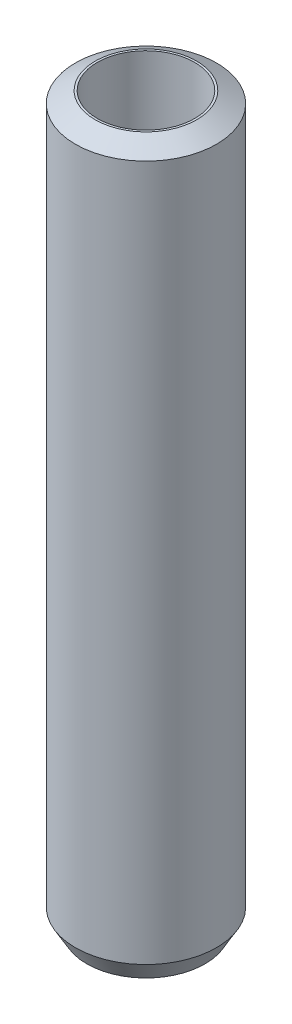
ISO-10303-21;
HEADER;
FILE_DESCRIPTION(('STEP AP214'),'2;1');
FILE_NAME('part.step','',(''),(''),'','','');
FILE_SCHEMA(('AUTOMOTIVE_DESIGN { 1 0 10303 214 1 1 1 1 }'));
ENDSEC;
DATA;
#1=APPLICATION_CONTEXT('core data for automotive mechanical design processes');
#2=APPLICATION_PROTOCOL_DEFINITION('international standard','automotive_design',2000,#1);
#3=PRODUCT_CONTEXT('',#1,'mechanical');
#4=PRODUCT('Part','Part','',(#3));
#5=PRODUCT_RELATED_PRODUCT_CATEGORY('part','',(#4));
#6=PRODUCT_DEFINITION_FORMATION('','',#4);
#7=PRODUCT_DEFINITION_CONTEXT('part definition',#1,'design');
#8=PRODUCT_DEFINITION('design','',#6,#7);
#9=PRODUCT_DEFINITION_SHAPE('','',#8);
#10=(LENGTH_UNIT() NAMED_UNIT(*) SI_UNIT(.MILLI.,.METRE.));
#11=(NAMED_UNIT(*) PLANE_ANGLE_UNIT() SI_UNIT($,.RADIAN.));
#12=(NAMED_UNIT(*) SI_UNIT($,.STERADIAN.) SOLID_ANGLE_UNIT());
#13=UNCERTAINTY_MEASURE_WITH_UNIT(LENGTH_MEASURE(1.E-05),#10,'distance_accuracy_value','');
#14=(GEOMETRIC_REPRESENTATION_CONTEXT(3) GLOBAL_UNCERTAINTY_ASSIGNED_CONTEXT((#13)) GLOBAL_UNIT_ASSIGNED_CONTEXT((#10,
#11,#12)) REPRESENTATION_CONTEXT('',''));
#15=CARTESIAN_POINT('',(0.,0.,0.));
#16=DIRECTION('',(0.,0.,1.));
#17=DIRECTION('',(1.,0.,0.));
#18=AXIS2_PLACEMENT_3D('',#15,#16,#17);
#19=CARTESIAN_POINT('',(0.,360.724396872839,0.));
#20=DIRECTION('',(0.,-1.,0.));
#21=DIRECTION('',(0.,0.,-1.));
#22=AXIS2_PLACEMENT_3D('',#19,#20,#21);
#23=CYLINDRICAL_SURFACE('',#22,35.);
#24=CARTESIAN_POINT('',(0.,355.077389899913,0.));
#25=DIRECTION('',(0.,1.,0.));
#26=DIRECTION('',(0.,0.,1.));
#27=AXIS2_PLACEMENT_3D('',#24,#25,#26);
#28=CIRCLE('',#27,35.);
#29=CARTESIAN_POINT('',(0.,355.077389899913,35.));
#30=VERTEX_POINT('',#29);
#31=EDGE_CURVE('E50',#30,#30,#28,.F.);
#32=ORIENTED_EDGE('',*,*,#31,.T.);
#33=EDGE_LOOP('',(#32));
#34=FACE_BOUND('',#33,.T.);
#35=CARTESIAN_POINT('',(0.,9.78090298780371,0.));
#36=DIRECTION('',(0.,1.,0.));
#37=DIRECTION('',(0.,0.,1.));
#38=AXIS2_PLACEMENT_3D('',#35,#36,#37);
#39=CIRCLE('',#38,35.);
#40=CARTESIAN_POINT('',(0.,9.78090298780371,35.));
#41=VERTEX_POINT('',#40);
#42=EDGE_CURVE('E51',#41,#41,#39,.T.);
#43=ORIENTED_EDGE('',*,*,#42,.T.);
#44=EDGE_LOOP('',(#43));
#45=FACE_BOUND('',#44,.T.);
#46=ADVANCED_FACE('F39',(#34,#45),#23,.T.);
#47=CARTESIAN_POINT('',(0.,360.724396872839,0.));
#48=DIRECTION('',(0.,1.,0.));
#49=DIRECTION('',(0.,0.,1.));
#50=AXIS2_PLACEMENT_3D('',#47,#48,#49);
#51=PLANE('',#50);
#52=CARTESIAN_POINT('',(0.,360.724396872839,0.));
#53=DIRECTION('',(0.,1.,0.));
#54=DIRECTION('',(0.,0.,1.));
#55=AXIS2_PLACEMENT_3D('',#52,#53,#54);
#56=CIRCLE('',#55,25.2190970121962);
#57=CARTESIAN_POINT('',(0.,360.724396872839,25.2190970121962));
#58=VERTEX_POINT('',#57);
#59=EDGE_CURVE('E54',#58,#58,#56,.T.);
#60=ORIENTED_EDGE('',*,*,#59,.T.);
#61=EDGE_LOOP('',(#60));
#62=FACE_BOUND('',#61,.T.);
#63=CARTESIAN_POINT('',(0.,360.724396872839,0.));
#64=DIRECTION('',(0.,1.,0.));
#65=DIRECTION('',(0.,0.,1.));
#66=AXIS2_PLACEMENT_3D('',#63,#64,#65);
#67=CIRCLE('',#66,24.1599780872119);
#68=CARTESIAN_POINT('',(0.,360.724396872839,24.1599780872119));
#69=VERTEX_POINT('',#68);
#70=EDGE_CURVE('E58',#69,#69,#67,.T.);
#71=ORIENTED_EDGE('',*,*,#70,.F.);
#72=EDGE_LOOP('',(#71));
#73=FACE_BOUND('',#72,.T.);
#74=ADVANCED_FACE('F69',(#62,#73),#51,.T.);
#75=CARTESIAN_POINT('',(0.,0.,0.));
#76=DIRECTION('',(0.,1.,0.));
#77=DIRECTION('',(0.,0.,1.));
#78=AXIS2_PLACEMENT_3D('',#75,#76,#77);
#79=PLANE('',#78);
#80=CARTESIAN_POINT('',(0.,0.,0.));
#81=DIRECTION('',(0.,1.,0.));
#82=DIRECTION('',(0.,0.,1.));
#83=AXIS2_PLACEMENT_3D('',#80,#81,#82);
#84=CIRCLE('',#83,29.3529930270739);
#85=CARTESIAN_POINT('',(0.,0.,29.3529930270739));
#86=VERTEX_POINT('',#85);
#87=EDGE_CURVE('E10',#86,#86,#84,.F.);
#88=ORIENTED_EDGE('',*,*,#87,.T.);
#89=EDGE_LOOP('',(#88));
#90=FACE_BOUND('',#89,.T.);
#91=CARTESIAN_POINT('',(0.,0.,0.));
#92=DIRECTION('',(0.,1.,0.));
#93=DIRECTION('',(0.,0.,1.));
#94=AXIS2_PLACEMENT_3D('',#91,#92,#93);
#95=CIRCLE('',#94,24.1599780872119);
#96=CARTESIAN_POINT('',(0.,0.,24.1599780872119));
#97=VERTEX_POINT('',#96);
#98=EDGE_CURVE('E63',#97,#97,#95,.T.);
#99=ORIENTED_EDGE('',*,*,#98,.T.);
#100=EDGE_LOOP('',(#99));
#101=FACE_BOUND('',#100,.T.);
#102=ADVANCED_FACE('F75',(#90,#101),#79,.F.);
#103=CARTESIAN_POINT('',(0.,360.724396872839,0.));
#104=DIRECTION('',(0.,-1.,0.));
#105=DIRECTION('',(0.,0.,-1.));
#106=AXIS2_PLACEMENT_3D('',#103,#104,#105);
#107=CYLINDRICAL_SURFACE('',#106,24.1599780872119);
#108=ORIENTED_EDGE('',*,*,#70,.T.);
#109=EDGE_LOOP('',(#108));
#110=FACE_BOUND('',#109,.T.);
#111=ORIENTED_EDGE('',*,*,#98,.F.);
#112=EDGE_LOOP('',(#111));
#113=FACE_BOUND('',#112,.T.);
#114=ADVANCED_FACE('F70',(#110,#113),#107,.F.);
#115=CARTESIAN_POINT('',(0.,360.724396872839,0.));
#116=DIRECTION('',(0.,-1.,0.));
#117=DIRECTION('',(0.,0.,-1.));
#118=AXIS2_PLACEMENT_3D('',#115,#116,#117);
#119=CONICAL_SURFACE('',#118,25.2190970121962,1.0471975511966);
#120=ORIENTED_EDGE('',*,*,#31,.F.);
#121=EDGE_LOOP('',(#120));
#122=FACE_BOUND('',#121,.T.);
#123=ORIENTED_EDGE('',*,*,#59,.F.);
#124=EDGE_LOOP('',(#123));
#125=FACE_BOUND('',#124,.T.);
#126=ADVANCED_FACE('F81',(#122,#125),#119,.T.);
#127=CARTESIAN_POINT('',(0.,9.78090298780371,0.));
#128=DIRECTION('',(0.,1.,0.));
#129=DIRECTION('',(0.,0.,1.));
#130=AXIS2_PLACEMENT_3D('',#127,#128,#129);
#131=CONICAL_SURFACE('',#130,35.,0.523598775598303);
#132=ORIENTED_EDGE('',*,*,#87,.F.);
#133=EDGE_LOOP('',(#132));
#134=FACE_BOUND('',#133,.T.);
#135=ORIENTED_EDGE('',*,*,#42,.F.);
#136=EDGE_LOOP('',(#135));
#137=FACE_BOUND('',#136,.T.);
#138=ADVANCED_FACE('F45',(#134,#137),#131,.T.);
#139=CLOSED_SHELL('',(#46,#74,#102,#114,#126,#138));
#140=MANIFOLD_SOLID_BREP('B2',#139);
#141=ADVANCED_BREP_SHAPE_REPRESENTATION('',(#18,#140),#14);
#142=SHAPE_DEFINITION_REPRESENTATION(#9,#141);
ENDSEC;
END-ISO-10303-21;
